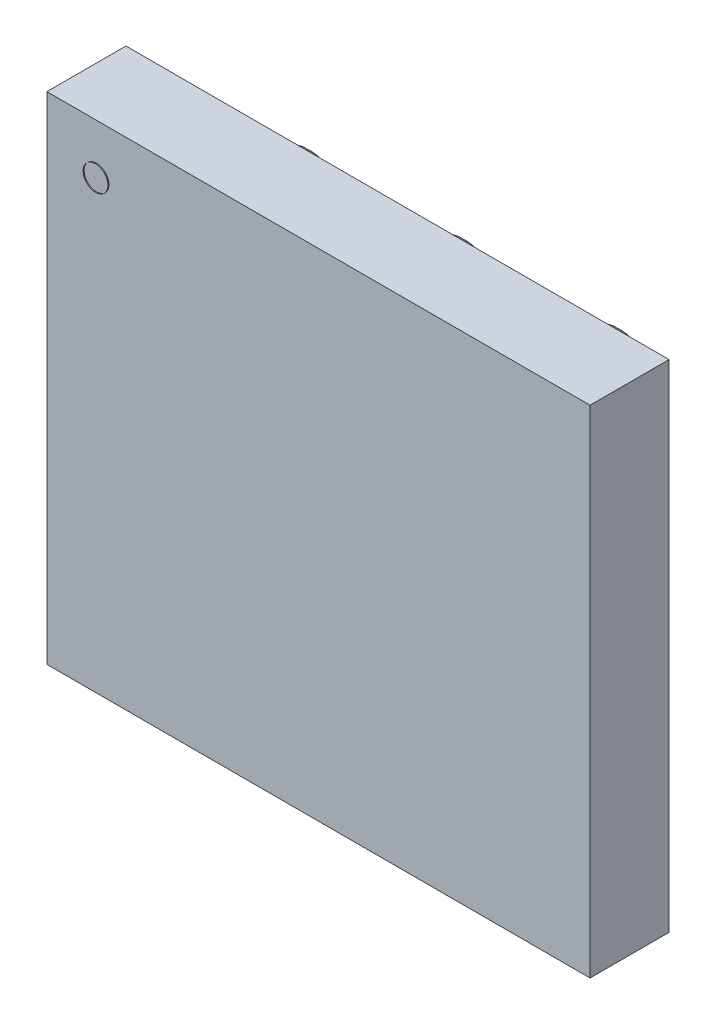
ISO-10303-21;
HEADER;
FILE_DESCRIPTION(('STEP AP214'),'2;1');
FILE_NAME('part.step','',(''),(''),'','','');
FILE_SCHEMA(('AUTOMOTIVE_DESIGN { 1 0 10303 214 1 1 1 1 }'));
ENDSEC;
DATA;
#1=APPLICATION_CONTEXT('core data for automotive mechanical design processes');
#2=APPLICATION_PROTOCOL_DEFINITION('international standard','automotive_design',2000,#1);
#3=PRODUCT_CONTEXT('',#1,'mechanical');
#4=PRODUCT('Part','Part','',(#3));
#5=PRODUCT_RELATED_PRODUCT_CATEGORY('part','',(#4));
#6=PRODUCT_DEFINITION_FORMATION('','',#4);
#7=PRODUCT_DEFINITION_CONTEXT('part definition',#1,'design');
#8=PRODUCT_DEFINITION('design','',#6,#7);
#9=PRODUCT_DEFINITION_SHAPE('','',#8);
#10=(LENGTH_UNIT() NAMED_UNIT(*) SI_UNIT(.MILLI.,.METRE.));
#11=(NAMED_UNIT(*) PLANE_ANGLE_UNIT() SI_UNIT($,.RADIAN.));
#12=(NAMED_UNIT(*) SI_UNIT($,.STERADIAN.) SOLID_ANGLE_UNIT());
#13=UNCERTAINTY_MEASURE_WITH_UNIT(LENGTH_MEASURE(1.E-05),#10,'distance_accuracy_value','');
#14=(GEOMETRIC_REPRESENTATION_CONTEXT(3) GLOBAL_UNCERTAINTY_ASSIGNED_CONTEXT((#13)) GLOBAL_UNIT_ASSIGNED_CONTEXT((#10,
#11,#12)) REPRESENTATION_CONTEXT('',''));
#15=CARTESIAN_POINT('',(0.,0.,0.));
#16=DIRECTION('',(0.,0.,1.));
#17=DIRECTION('',(1.,0.,0.));
#18=AXIS2_PLACEMENT_3D('',#15,#16,#17);
#19=CARTESIAN_POINT('',(-0.5,0.5,-0.123));
#20=DIRECTION('',(-1.,0.,0.));
#21=DIRECTION('',(0.,1.,0.));
#22=AXIS2_PLACEMENT_3D('',#19,#20,#21);
#23=SPHERICAL_SURFACE('',#22,0.127);
#24=CARTESIAN_POINT('',(-0.373,0.5,-0.123));
#25=VERTEX_POINT('',#24);
#26=VERTEX_LOOP('',#25);
#27=FACE_BOUND('',#26,.T.);
#28=CARTESIAN_POINT('',(-0.627,0.5,-0.123));
#29=VERTEX_POINT('',#28);
#30=VERTEX_LOOP('',#29);
#31=FACE_BOUND('',#30,.T.);
#32=ADVANCED_FACE('P0_F16',(#27,#31),#23,.T.);
#33=CLOSED_SHELL('',(#32));
#34=MANIFOLD_SOLID_BREP('P0_B1',#33);
#35=CARTESIAN_POINT('',(-0.5,0.,-0.123));
#36=DIRECTION('',(-1.,0.,0.));
#37=DIRECTION('',(0.,1.,0.));
#38=AXIS2_PLACEMENT_3D('',#35,#36,#37);
#39=SPHERICAL_SURFACE('',#38,0.127);
#40=CARTESIAN_POINT('',(-0.373,0.,-0.123));
#41=VERTEX_POINT('',#40);
#42=VERTEX_LOOP('',#41);
#43=FACE_BOUND('',#42,.T.);
#44=CARTESIAN_POINT('',(-0.627,0.,-0.123));
#45=VERTEX_POINT('',#44);
#46=VERTEX_LOOP('',#45);
#47=FACE_BOUND('',#46,.T.);
#48=ADVANCED_FACE('P1_F16',(#43,#47),#39,.T.);
#49=CLOSED_SHELL('',(#48));
#50=MANIFOLD_SOLID_BREP('P1_B1',#49);
#51=CARTESIAN_POINT('',(0.,0.5,-0.123));
#52=DIRECTION('',(-1.,0.,0.));
#53=DIRECTION('',(0.,1.,0.));
#54=AXIS2_PLACEMENT_3D('',#51,#52,#53);
#55=SPHERICAL_SURFACE('',#54,0.127);
#56=CARTESIAN_POINT('',(0.127,0.5,-0.123));
#57=VERTEX_POINT('',#56);
#58=VERTEX_LOOP('',#57);
#59=FACE_BOUND('',#58,.T.);
#60=CARTESIAN_POINT('',(-0.127,0.5,-0.123));
#61=VERTEX_POINT('',#60);
#62=VERTEX_LOOP('',#61);
#63=FACE_BOUND('',#62,.T.);
#64=ADVANCED_FACE('P2_F16',(#59,#63),#55,.T.);
#65=CLOSED_SHELL('',(#64));
#66=MANIFOLD_SOLID_BREP('P2_B1',#65);
#67=CARTESIAN_POINT('',(0.5,-0.5,-0.123));
#68=DIRECTION('',(-1.,0.,0.));
#69=DIRECTION('',(0.,1.,0.));
#70=AXIS2_PLACEMENT_3D('',#67,#68,#69);
#71=SPHERICAL_SURFACE('',#70,0.127);
#72=CARTESIAN_POINT('',(0.627,-0.5,-0.123));
#73=VERTEX_POINT('',#72);
#74=VERTEX_LOOP('',#73);
#75=FACE_BOUND('',#74,.T.);
#76=CARTESIAN_POINT('',(0.373,-0.5,-0.123));
#77=VERTEX_POINT('',#76);
#78=VERTEX_LOOP('',#77);
#79=FACE_BOUND('',#78,.T.);
#80=ADVANCED_FACE('P3_F16',(#75,#79),#71,.T.);
#81=CLOSED_SHELL('',(#80));
#82=MANIFOLD_SOLID_BREP('P3_B1',#81);
#83=CARTESIAN_POINT('',(-0.876,-0.8,0.258));
#84=DIRECTION('',(0.,0.,1.));
#85=DIRECTION('',(1.,0.,0.));
#86=AXIS2_PLACEMENT_3D('',#83,#84,#85);
#87=PLANE('',#86);
#88=DIRECTION('',(1.,0.,0.));
#89=VECTOR('',#88,1.);
#90=CARTESIAN_POINT('',(0.876,0.8,0.258));
#91=LINE('',#90,#89);
#92=CARTESIAN_POINT('',(-0.876,0.8,0.258));
#93=VERTEX_POINT('',#92);
#94=CARTESIAN_POINT('',(0.876,0.8,0.258));
#95=VERTEX_POINT('',#94);
#96=EDGE_CURVE('P4_E62',#93,#95,#91,.T.);
#97=ORIENTED_EDGE('',*,*,#96,.F.);
#98=DIRECTION('',(0.,1.,0.));
#99=VECTOR('',#98,1.);
#100=CARTESIAN_POINT('',(-0.876,-0.8,0.258));
#101=LINE('',#100,#99);
#102=CARTESIAN_POINT('',(-0.876,-0.8,0.258));
#103=VERTEX_POINT('',#102);
#104=EDGE_CURVE('P4_E20',#93,#103,#101,.F.);
#105=ORIENTED_EDGE('',*,*,#104,.T.);
#106=DIRECTION('',(1.,0.,0.));
#107=VECTOR('',#106,1.);
#108=CARTESIAN_POINT('',(-0.876,-0.8,0.258));
#109=LINE('',#108,#107);
#110=CARTESIAN_POINT('',(0.876,-0.8,0.258));
#111=VERTEX_POINT('',#110);
#112=EDGE_CURVE('P4_E69',#111,#103,#109,.F.);
#113=ORIENTED_EDGE('',*,*,#112,.F.);
#114=DIRECTION('',(0.,1.,0.));
#115=VECTOR('',#114,1.);
#116=CARTESIAN_POINT('',(0.876,-0.8,0.258));
#117=LINE('',#116,#115);
#118=EDGE_CURVE('P4_E56',#95,#111,#117,.F.);
#119=ORIENTED_EDGE('',*,*,#118,.F.);
#120=EDGE_LOOP('',(#97,#105,#113,#119));
#121=FACE_BOUND('',#120,.T.);
#122=ADVANCED_FACE('P4_F17',(#121),#87,.T.);
#123=CARTESIAN_POINT('',(0.876,0.8,0.00300000000000009));
#124=DIRECTION('',(0.,1.,0.));
#125=DIRECTION('',(0.,0.,1.));
#126=AXIS2_PLACEMENT_3D('',#123,#124,#125);
#127=PLANE('',#126);
#128=ORIENTED_EDGE('',*,*,#96,.T.);
#129=DIRECTION('',(0.,0.,-1.));
#130=VECTOR('',#129,1.);
#131=CARTESIAN_POINT('',(0.876,0.8,0.00300000000000009));
#132=LINE('',#131,#130);
#133=CARTESIAN_POINT('',(0.876,0.8,0.00300000000000009));
#134=VERTEX_POINT('',#133);
#135=EDGE_CURVE('P4_E64',#134,#95,#132,.F.);
#136=ORIENTED_EDGE('',*,*,#135,.F.);
#137=DIRECTION('',(-1.,0.,0.));
#138=VECTOR('',#137,1.);
#139=CARTESIAN_POINT('',(-0.876,0.8,0.00300000000000009));
#140=LINE('',#139,#138);
#141=CARTESIAN_POINT('',(-0.876,0.8,0.00300000000000009));
#142=VERTEX_POINT('',#141);
#143=EDGE_CURVE('P4_E83',#142,#134,#140,.F.);
#144=ORIENTED_EDGE('',*,*,#143,.F.);
#145=DIRECTION('',(0.,0.,1.));
#146=VECTOR('',#145,1.);
#147=CARTESIAN_POINT('',(-0.876,0.8,0.00300000000000009));
#148=LINE('',#147,#146);
#149=EDGE_CURVE('P4_E67',#93,#142,#148,.F.);
#150=ORIENTED_EDGE('',*,*,#149,.F.);
#151=EDGE_LOOP('',(#128,#136,#144,#150));
#152=FACE_BOUND('',#151,.T.);
#153=ADVANCED_FACE('P4_F63',(#152),#127,.T.);
#154=CARTESIAN_POINT('',(0.876,-0.8,0.00300000000000009));
#155=DIRECTION('',(1.,0.,0.));
#156=DIRECTION('',(0.,0.,-1.));
#157=AXIS2_PLACEMENT_3D('',#154,#155,#156);
#158=PLANE('',#157);
#159=ORIENTED_EDGE('',*,*,#118,.T.);
#160=DIRECTION('',(0.,0.,-1.));
#161=VECTOR('',#160,1.);
#162=CARTESIAN_POINT('',(0.876,-0.8,0.00300000000000009));
#163=LINE('',#162,#161);
#164=CARTESIAN_POINT('',(0.876,-0.8,0.00300000000000009));
#165=VERTEX_POINT('',#164);
#166=EDGE_CURVE('P4_E71',#165,#111,#163,.F.);
#167=ORIENTED_EDGE('',*,*,#166,.F.);
#168=DIRECTION('',(0.,1.,0.));
#169=VECTOR('',#168,1.);
#170=CARTESIAN_POINT('',(0.876,0.8,0.00300000000000009));
#171=LINE('',#170,#169);
#172=EDGE_CURVE('P4_E75',#134,#165,#171,.F.);
#173=ORIENTED_EDGE('',*,*,#172,.F.);
#174=ORIENTED_EDGE('',*,*,#135,.T.);
#175=EDGE_LOOP('',(#159,#167,#173,#174));
#176=FACE_BOUND('',#175,.T.);
#177=ADVANCED_FACE('P4_F73',(#176),#158,.T.);
#178=CARTESIAN_POINT('',(-0.876,-0.8,0.00300000000000009));
#179=DIRECTION('',(0.,-1.,0.));
#180=DIRECTION('',(0.,0.,-1.));
#181=AXIS2_PLACEMENT_3D('',#178,#179,#180);
#182=PLANE('',#181);
#183=ORIENTED_EDGE('',*,*,#112,.T.);
#184=DIRECTION('',(0.,0.,1.));
#185=VECTOR('',#184,1.);
#186=CARTESIAN_POINT('',(-0.876,-0.8,0.00300000000000009));
#187=LINE('',#186,#185);
#188=CARTESIAN_POINT('',(-0.876,-0.8,0.00300000000000009));
#189=VERTEX_POINT('',#188);
#190=EDGE_CURVE('P4_E35',#189,#103,#187,.T.);
#191=ORIENTED_EDGE('',*,*,#190,.F.);
#192=DIRECTION('',(-1.,0.,0.));
#193=VECTOR('',#192,1.);
#194=CARTESIAN_POINT('',(-0.876,-0.8,0.00300000000000009));
#195=LINE('',#194,#193);
#196=EDGE_CURVE('P4_E26',#165,#189,#195,.T.);
#197=ORIENTED_EDGE('',*,*,#196,.F.);
#198=ORIENTED_EDGE('',*,*,#166,.T.);
#199=EDGE_LOOP('',(#183,#191,#197,#198));
#200=FACE_BOUND('',#199,.T.);
#201=ADVANCED_FACE('P4_F89',(#200),#182,.T.);
#202=CARTESIAN_POINT('',(-0.876,0.8,0.00300000000000009));
#203=DIRECTION('',(-1.,0.,0.));
#204=DIRECTION('',(0.,0.,1.));
#205=AXIS2_PLACEMENT_3D('',#202,#203,#204);
#206=PLANE('',#205);
#207=ORIENTED_EDGE('',*,*,#104,.F.);
#208=ORIENTED_EDGE('',*,*,#149,.T.);
#209=DIRECTION('',(0.,1.,0.));
#210=VECTOR('',#209,1.);
#211=CARTESIAN_POINT('',(-0.876,0.8,0.00300000000000009));
#212=LINE('',#211,#210);
#213=EDGE_CURVE('P4_E11',#189,#142,#212,.T.);
#214=ORIENTED_EDGE('',*,*,#213,.F.);
#215=ORIENTED_EDGE('',*,*,#190,.T.);
#216=EDGE_LOOP('',(#207,#208,#214,#215));
#217=FACE_BOUND('',#216,.T.);
#218=ADVANCED_FACE('P4_F91',(#217),#206,.T.);
#219=CARTESIAN_POINT('',(-0.876,0.8,0.00300000000000009));
#220=DIRECTION('',(0.,0.,-1.));
#221=DIRECTION('',(-1.,0.,0.));
#222=AXIS2_PLACEMENT_3D('',#219,#220,#221);
#223=PLANE('',#222);
#224=ORIENTED_EDGE('',*,*,#196,.T.);
#225=ORIENTED_EDGE('',*,*,#213,.T.);
#226=ORIENTED_EDGE('',*,*,#143,.T.);
#227=ORIENTED_EDGE('',*,*,#172,.T.);
#228=EDGE_LOOP('',(#224,#225,#226,#227));
#229=FACE_BOUND('',#228,.T.);
#230=ADVANCED_FACE('P4_F88',(#229),#223,.T.);
#231=CLOSED_SHELL('',(#122,#153,#177,#201,#218,#230));
#232=MANIFOLD_SOLID_BREP('P4_B1',#231);
#233=CARTESIAN_POINT('',(-0.5,-0.5,-0.123));
#234=DIRECTION('',(-1.,0.,0.));
#235=DIRECTION('',(0.,1.,0.));
#236=AXIS2_PLACEMENT_3D('',#233,#234,#235);
#237=SPHERICAL_SURFACE('',#236,0.127);
#238=CARTESIAN_POINT('',(-0.373,-0.5,-0.123));
#239=VERTEX_POINT('',#238);
#240=VERTEX_LOOP('',#239);
#241=FACE_BOUND('',#240,.T.);
#242=CARTESIAN_POINT('',(-0.627,-0.5,-0.123));
#243=VERTEX_POINT('',#242);
#244=VERTEX_LOOP('',#243);
#245=FACE_BOUND('',#244,.T.);
#246=ADVANCED_FACE('P5_F16',(#241,#245),#237,.T.);
#247=CLOSED_SHELL('',(#246));
#248=MANIFOLD_SOLID_BREP('P5_B1',#247);
#249=CARTESIAN_POINT('',(0.,-0.5,-0.123));
#250=DIRECTION('',(-1.,0.,0.));
#251=DIRECTION('',(0.,1.,0.));
#252=AXIS2_PLACEMENT_3D('',#249,#250,#251);
#253=SPHERICAL_SURFACE('',#252,0.127);
#254=CARTESIAN_POINT('',(0.127,-0.5,-0.123));
#255=VERTEX_POINT('',#254);
#256=VERTEX_LOOP('',#255);
#257=FACE_BOUND('',#256,.T.);
#258=CARTESIAN_POINT('',(-0.127,-0.5,-0.123));
#259=VERTEX_POINT('',#258);
#260=VERTEX_LOOP('',#259);
#261=FACE_BOUND('',#260,.T.);
#262=ADVANCED_FACE('P6_F16',(#257,#261),#253,.T.);
#263=CLOSED_SHELL('',(#262));
#264=MANIFOLD_SOLID_BREP('P6_B1',#263);
#265=CARTESIAN_POINT('',(0.,0.,-0.123));
#266=DIRECTION('',(-1.,0.,0.));
#267=DIRECTION('',(0.,1.,0.));
#268=AXIS2_PLACEMENT_3D('',#265,#266,#267);
#269=SPHERICAL_SURFACE('',#268,0.127);
#270=CARTESIAN_POINT('',(0.127,0.,-0.123));
#271=VERTEX_POINT('',#270);
#272=VERTEX_LOOP('',#271);
#273=FACE_BOUND('',#272,.T.);
#274=CARTESIAN_POINT('',(-0.127,0.,-0.123));
#275=VERTEX_POINT('',#274);
#276=VERTEX_LOOP('',#275);
#277=FACE_BOUND('',#276,.T.);
#278=ADVANCED_FACE('P7_F16',(#273,#277),#269,.T.);
#279=CLOSED_SHELL('',(#278));
#280=MANIFOLD_SOLID_BREP('P7_B1',#279);
#281=CARTESIAN_POINT('',(0.5,0.5,-0.123));
#282=DIRECTION('',(-1.,0.,0.));
#283=DIRECTION('',(0.,1.,0.));
#284=AXIS2_PLACEMENT_3D('',#281,#282,#283);
#285=SPHERICAL_SURFACE('',#284,0.127);
#286=CARTESIAN_POINT('',(0.627,0.5,-0.123));
#287=VERTEX_POINT('',#286);
#288=VERTEX_LOOP('',#287);
#289=FACE_BOUND('',#288,.T.);
#290=CARTESIAN_POINT('',(0.373,0.5,-0.123));
#291=VERTEX_POINT('',#290);
#292=VERTEX_LOOP('',#291);
#293=FACE_BOUND('',#292,.T.);
#294=ADVANCED_FACE('P8_F16',(#289,#293),#285,.T.);
#295=CLOSED_SHELL('',(#294));
#296=MANIFOLD_SOLID_BREP('P8_B1',#295);
#297=CARTESIAN_POINT('',(0.5,0.,-0.123));
#298=DIRECTION('',(-1.,0.,0.));
#299=DIRECTION('',(0.,1.,0.));
#300=AXIS2_PLACEMENT_3D('',#297,#298,#299);
#301=SPHERICAL_SURFACE('',#300,0.127);
#302=CARTESIAN_POINT('',(0.627,0.,-0.123));
#303=VERTEX_POINT('',#302);
#304=VERTEX_LOOP('',#303);
#305=FACE_BOUND('',#304,.T.);
#306=CARTESIAN_POINT('',(0.373,0.,-0.123));
#307=VERTEX_POINT('',#306);
#308=VERTEX_LOOP('',#307);
#309=FACE_BOUND('',#308,.T.);
#310=ADVANCED_FACE('P9_F16',(#305,#309),#301,.T.);
#311=CLOSED_SHELL('',(#310));
#312=MANIFOLD_SOLID_BREP('P9_B1',#311);
#313=CARTESIAN_POINT('',(-0.716,0.64,0.258));
#314=DIRECTION('',(0.,0.,1.));
#315=DIRECTION('',(1.,0.,0.));
#316=AXIS2_PLACEMENT_3D('',#313,#314,#315);
#317=CYLINDRICAL_SURFACE('',#316,0.040005);
#318=CARTESIAN_POINT('',(-0.716,0.64,0.258));
#319=DIRECTION('',(0.,0.,1.));
#320=DIRECTION('',(1.,0.,0.));
#321=AXIS2_PLACEMENT_3D('',#318,#319,#320);
#322=CIRCLE('',#321,0.040005);
#323=CARTESIAN_POINT('',(-0.675995,0.64,0.258));
#324=VERTEX_POINT('',#323);
#325=EDGE_CURVE('P10_E10',#324,#324,#322,.T.);
#326=ORIENTED_EDGE('',*,*,#325,.T.);
#327=EDGE_LOOP('',(#326));
#328=FACE_BOUND('',#327,.T.);
#329=CARTESIAN_POINT('',(-0.716,0.64,0.261));
#330=DIRECTION('',(0.,0.,1.));
#331=DIRECTION('',(1.,0.,0.));
#332=AXIS2_PLACEMENT_3D('',#329,#330,#331);
#333=CIRCLE('',#332,0.040005);
#334=CARTESIAN_POINT('',(-0.675995,0.64,0.261));
#335=VERTEX_POINT('',#334);
#336=EDGE_CURVE('P10_E16',#335,#335,#333,.F.);
#337=ORIENTED_EDGE('',*,*,#336,.T.);
#338=EDGE_LOOP('',(#337));
#339=FACE_BOUND('',#338,.T.);
#340=ADVANCED_FACE('P10_F15',(#328,#339),#317,.T.);
#341=OPEN_SHELL('',(#340));
#342=SHELL_BASED_SURFACE_MODEL('P10_B1',(#341));
#343=ADVANCED_BREP_SHAPE_REPRESENTATION('',(#18,#34,#50,#66,#82,#232,#248,#264,#280,#296,#312),#14);
#344=MANIFOLD_SURFACE_SHAPE_REPRESENTATION('',(#18,#342),#14);
#345=SHAPE_REPRESENTATION('',(#18),#14);
#346=SHAPE_DEFINITION_REPRESENTATION(#9,#345);
#347=SHAPE_REPRESENTATION_RELATIONSHIP('','',#345,#343);
#348=SHAPE_REPRESENTATION_RELATIONSHIP('','',#345,#344);
ENDSEC;
END-ISO-10303-21;
